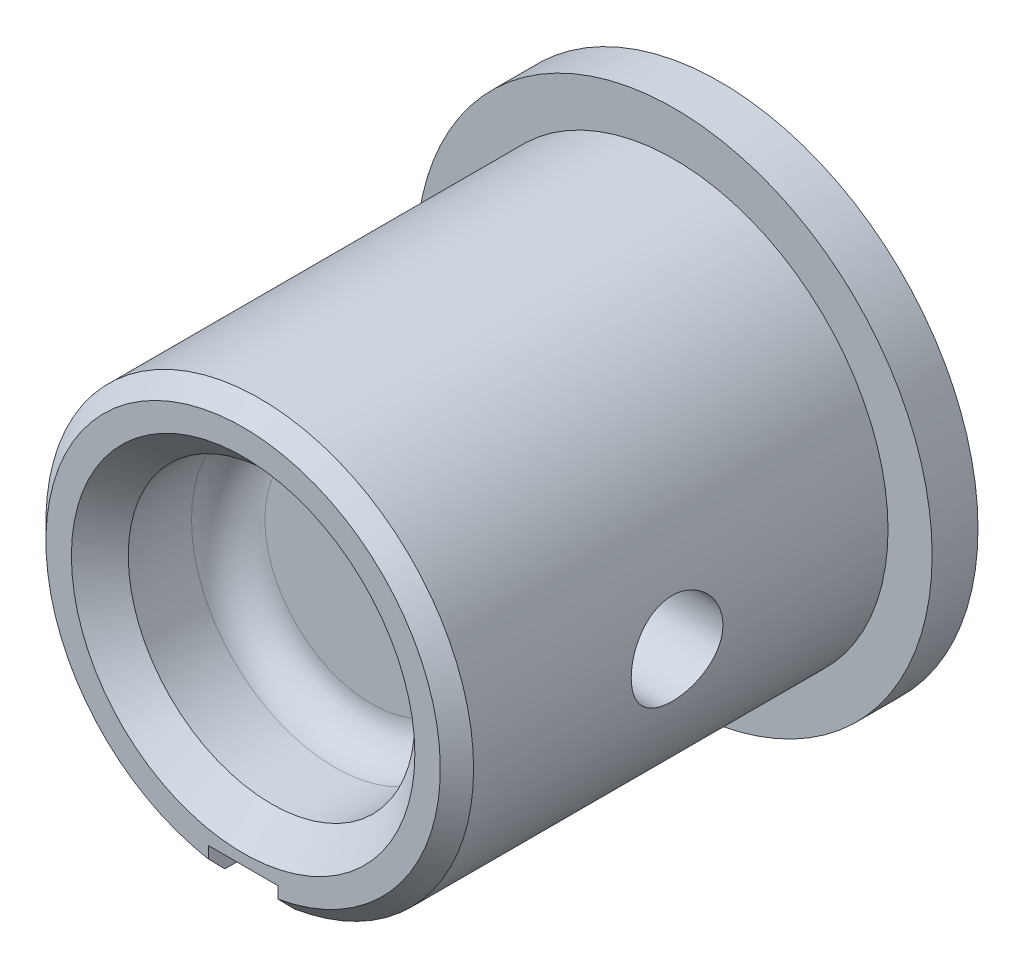
ISO-10303-21;
HEADER;
FILE_DESCRIPTION(('STEP AP214'),'2;1');
FILE_NAME('part.step','',(''),(''),'','','');
FILE_SCHEMA(('AUTOMOTIVE_DESIGN { 1 0 10303 214 1 1 1 1 }'));
ENDSEC;
DATA;
#1=APPLICATION_CONTEXT('core data for automotive mechanical design processes');
#2=APPLICATION_PROTOCOL_DEFINITION('international standard','automotive_design',2000,#1);
#3=PRODUCT_CONTEXT('',#1,'mechanical');
#4=PRODUCT('Part','Part','',(#3));
#5=PRODUCT_RELATED_PRODUCT_CATEGORY('part','',(#4));
#6=PRODUCT_DEFINITION_FORMATION('','',#4);
#7=PRODUCT_DEFINITION_CONTEXT('part definition',#1,'design');
#8=PRODUCT_DEFINITION('design','',#6,#7);
#9=PRODUCT_DEFINITION_SHAPE('','',#8);
#10=(LENGTH_UNIT() NAMED_UNIT(*) SI_UNIT(.MILLI.,.METRE.));
#11=(NAMED_UNIT(*) PLANE_ANGLE_UNIT() SI_UNIT($,.RADIAN.));
#12=(NAMED_UNIT(*) SI_UNIT($,.STERADIAN.) SOLID_ANGLE_UNIT());
#13=UNCERTAINTY_MEASURE_WITH_UNIT(LENGTH_MEASURE(1.E-05),#10,'distance_accuracy_value','');
#14=(GEOMETRIC_REPRESENTATION_CONTEXT(3) GLOBAL_UNCERTAINTY_ASSIGNED_CONTEXT((#13)) GLOBAL_UNIT_ASSIGNED_CONTEXT((#10,
#11,#12)) REPRESENTATION_CONTEXT('',''));
#15=CARTESIAN_POINT('',(0.,0.,0.));
#16=DIRECTION('',(0.,0.,1.));
#17=DIRECTION('',(1.,0.,0.));
#18=AXIS2_PLACEMENT_3D('',#15,#16,#17);
#19=CARTESIAN_POINT('',(2.96275000000001,2.96275000000001,8.382));
#20=DIRECTION('',(0.,0.,1.));
#21=DIRECTION('',(-1.,0.,0.));
#22=AXIS2_PLACEMENT_3D('',#19,#20,#21);
#23=PLANE('',#22);
#24=CARTESIAN_POINT('',(0.,0.,8.382));
#25=DIRECTION('',(0.,0.,-1.));
#26=DIRECTION('',(-1.,0.,0.));
#27=AXIS2_PLACEMENT_3D('',#24,#25,#26);
#28=CIRCLE('',#27,2.95275);
#29=CARTESIAN_POINT('',(-2.95275,0.,8.382));
#30=VERTEX_POINT('',#29);
#31=EDGE_CURVE('E21',#30,#30,#28,.T.);
#32=ORIENTED_EDGE('',*,*,#31,.F.);
#33=EDGE_LOOP('',(#32));
#34=FACE_BOUND('',#33,.T.);
#35=ADVANCED_FACE('F16',(#34),#23,.T.);
#36=CARTESIAN_POINT('',(0.,0.,9.398));
#37=DIRECTION('',(0.,0.,-1.));
#38=DIRECTION('',(-1.,0.,0.));
#39=AXIS2_PLACEMENT_3D('',#36,#37,#38);
#40=TOROIDAL_SURFACE('',#39,2.95275,1.016);
#41=CARTESIAN_POINT('',(0.,0.,9.398));
#42=DIRECTION('',(0.,0.,-1.));
#43=DIRECTION('',(-1.,0.,0.));
#44=AXIS2_PLACEMENT_3D('',#41,#42,#43);
#45=CIRCLE('',#44,3.96875);
#46=CARTESIAN_POINT('',(-3.96875,0.,9.398));
#47=VERTEX_POINT('',#46);
#48=EDGE_CURVE('E109',#47,#47,#45,.T.);
#49=ORIENTED_EDGE('',*,*,#48,.F.);
#50=EDGE_LOOP('',(#49));
#51=FACE_BOUND('',#50,.T.);
#52=ORIENTED_EDGE('',*,*,#31,.T.);
#53=EDGE_LOOP('',(#52));
#54=FACE_BOUND('',#53,.T.);
#55=ADVANCED_FACE('F172',(#51,#54),#40,.F.);
#56=CARTESIAN_POINT('',(7.15375000000001,-7.15375000000001,-1.26999999999999));
#57=DIRECTION('',(0.,0.,-1.));
#58=DIRECTION('',(-1.,0.,0.));
#59=AXIS2_PLACEMENT_3D('',#56,#57,#58);
#60=PLANE('',#59);
#61=CARTESIAN_POINT('',(0.,0.,-1.26999999999999));
#62=DIRECTION('',(0.,0.,1.));
#63=DIRECTION('',(1.,0.,0.));
#64=AXIS2_PLACEMENT_3D('',#61,#62,#63);
#65=CIRCLE('',#64,7.14375);
#66=CARTESIAN_POINT('',(7.14375,0.,-1.26999999999999));
#67=VERTEX_POINT('',#66);
#68=EDGE_CURVE('E108',#67,#67,#65,.T.);
#69=ORIENTED_EDGE('',*,*,#68,.F.);
#70=EDGE_LOOP('',(#69));
#71=FACE_BOUND('',#70,.T.);
#72=ADVANCED_FACE('F169',(#71),#60,.T.);
#73=CARTESIAN_POINT('',(0.,0.,11.1506));
#74=DIRECTION('',(0.,0.,-1.));
#75=DIRECTION('',(-1.,0.,0.));
#76=AXIS2_PLACEMENT_3D('',#73,#74,#75);
#77=CYLINDRICAL_SURFACE('',#76,3.96875);
#78=ORIENTED_EDGE('',*,*,#48,.T.);
#79=EDGE_LOOP('',(#78));
#80=FACE_BOUND('',#79,.T.);
#81=CARTESIAN_POINT('',(0.,0.,11.1506));
#82=DIRECTION('',(0.,0.,-1.));
#83=DIRECTION('',(-1.,0.,0.));
#84=AXIS2_PLACEMENT_3D('',#81,#82,#83);
#85=CIRCLE('',#84,3.96875);
#86=CARTESIAN_POINT('',(-3.96875,0.,11.1506));
#87=VERTEX_POINT('',#86);
#88=EDGE_CURVE('E104',#87,#87,#85,.T.);
#89=ORIENTED_EDGE('',*,*,#88,.F.);
#90=EDGE_LOOP('',(#89));
#91=FACE_BOUND('',#90,.T.);
#92=ADVANCED_FACE('F171',(#80,#91),#77,.F.);
#93=CARTESIAN_POINT('',(0.,0.,-1.27));
#94=DIRECTION('',(0.,0.,1.));
#95=DIRECTION('',(1.,0.,0.));
#96=AXIS2_PLACEMENT_3D('',#93,#94,#95);
#97=CYLINDRICAL_SURFACE('',#96,7.14375);
#98=CARTESIAN_POINT('',(0.,0.,0.));
#99=DIRECTION('',(0.,0.,1.));
#100=DIRECTION('',(1.,0.,0.));
#101=AXIS2_PLACEMENT_3D('',#98,#99,#100);
#102=CIRCLE('',#101,7.14375);
#103=CARTESIAN_POINT('',(7.14375,0.,0.));
#104=VERTEX_POINT('',#103);
#105=EDGE_CURVE('E107',#104,#104,#102,.T.);
#106=ORIENTED_EDGE('',*,*,#105,.F.);
#107=EDGE_LOOP('',(#106));
#108=FACE_BOUND('',#107,.T.);
#109=ORIENTED_EDGE('',*,*,#68,.T.);
#110=EDGE_LOOP('',(#109));
#111=FACE_BOUND('',#110,.T.);
#112=ADVANCED_FACE('F167',(#108,#111),#97,.T.);
#113=CARTESIAN_POINT('',(0.,0.,11.1506));
#114=DIRECTION('',(0.,0.,1.));
#115=DIRECTION('',(1.,0.,0.));
#116=AXIS2_PLACEMENT_3D('',#113,#114,#115);
#117=CONICAL_SURFACE('',#116,3.96875,0.785398163397448);
#118=ORIENTED_EDGE('',*,*,#88,.T.);
#119=EDGE_LOOP('',(#118));
#120=FACE_BOUND('',#119,.T.);
#121=CARTESIAN_POINT('',(0.,0.,11.938));
#122=DIRECTION('',(0.,0.,1.));
#123=DIRECTION('',(1.,0.,0.));
#124=AXIS2_PLACEMENT_3D('',#121,#122,#123);
#125=CIRCLE('',#124,4.75615);
#126=CARTESIAN_POINT('',(4.75615,0.,11.938));
#127=VERTEX_POINT('',#126);
#128=EDGE_CURVE('E153',#127,#127,#125,.F.);
#129=ORIENTED_EDGE('',*,*,#128,.F.);
#130=EDGE_LOOP('',(#129));
#131=FACE_BOUND('',#130,.T.);
#132=ADVANCED_FACE('F211',(#120,#131),#117,.F.);
#133=CARTESIAN_POINT('',(-7.15375000000001,-7.15374999999999,0.));
#134=DIRECTION('',(0.,0.,1.));
#135=DIRECTION('',(1.,0.,0.));
#136=AXIS2_PLACEMENT_3D('',#133,#134,#135);
#137=PLANE('',#136);
#138=CARTESIAN_POINT('',(0.,0.,0.));
#139=DIRECTION('',(0.,0.,1.));
#140=DIRECTION('',(1.,0.,0.));
#141=AXIS2_PLACEMENT_3D('',#138,#139,#140);
#142=CIRCLE('',#141,5.92201);
#143=CARTESIAN_POINT('',(5.92201,0.,0.));
#144=VERTEX_POINT('',#143);
#145=EDGE_CURVE('E152',#144,#144,#142,.T.);
#146=ORIENTED_EDGE('',*,*,#145,.F.);
#147=EDGE_LOOP('',(#146));
#148=FACE_BOUND('',#147,.T.);
#149=ORIENTED_EDGE('',*,*,#105,.T.);
#150=EDGE_LOOP('',(#149));
#151=FACE_BOUND('',#150,.T.);
#152=ADVANCED_FACE('F208',(#148,#151),#137,.T.);
#153=CARTESIAN_POINT('',(0.,0.,11.47699));
#154=DIRECTION('',(0.,0.,-1.));
#155=DIRECTION('',(-1.,0.,0.));
#156=AXIS2_PLACEMENT_3D('',#153,#154,#155);
#157=CONICAL_SURFACE('',#156,5.92201,0.785398163397456);
#158=CARTESIAN_POINT('',(0.9652,-5.84282392342093,11.47699));
#159=CARTESIAN_POINT('',(0.965200000000001,-5.76490383498512,11.5538718263506));
#160=CARTESIAN_POINT('',(0.965200000000001,-5.68696067294473,11.6307302393856));
#161=CARTESIAN_POINT('',(0.965200000000001,-5.53102820108529,11.784400239386));
#162=CARTESIAN_POINT('',(0.965200000000002,-5.4530388912659,11.8612118263509));
#163=CARTESIAN_POINT('',(0.965200000000002,-5.37502650784161,11.938));
#164=B_SPLINE_CURVE_WITH_KNOTS('',3,(#158,#159,#160,#161,#162,#163),.UNSPECIFIED.,.F.,.F.,(4,2,
4),(0.,0.32839179263205,0.656783587662925),.UNSPECIFIED.);
#165=CARTESIAN_POINT('',(0.965200000000001,-5.84282392342093,11.47699));
#166=VERTEX_POINT('',#165);
#167=CARTESIAN_POINT('',(0.965200000000002,-5.37502650784161,11.938));
#168=VERTEX_POINT('',#167);
#169=EDGE_CURVE('E86',#166,#168,#164,.T.);
#170=ORIENTED_EDGE('',*,*,#169,.F.);
#171=CARTESIAN_POINT('',(0.,0.,11.47699));
#172=DIRECTION('',(0.,0.,-1.));
#173=DIRECTION('',(-1.,0.,0.));
#174=AXIS2_PLACEMENT_3D('',#171,#172,#173);
#175=CIRCLE('',#174,5.92201);
#176=CARTESIAN_POINT('',(-0.9652,-5.84282392342093,11.47699));
#177=VERTEX_POINT('',#176);
#178=EDGE_CURVE('E196',#177,#166,#175,.T.);
#179=ORIENTED_EDGE('',*,*,#178,.F.);
#180=CARTESIAN_POINT('',(-0.9652,-5.84282392342093,11.47699));
#181=CARTESIAN_POINT('',(-0.9652,-5.76490383498512,11.5538718263506));
#182=CARTESIAN_POINT('',(-0.9652,-5.68696067294473,11.6307302393856));
#183=CARTESIAN_POINT('',(-0.9652,-5.53102820108529,11.784400239386));
#184=CARTESIAN_POINT('',(-0.9652,-5.4530388912659,11.8612118263509));
#185=CARTESIAN_POINT('',(-0.9652,-5.37502650784161,11.938));
#186=B_SPLINE_CURVE_WITH_KNOTS('',3,(#180,#181,#182,#183,#184,#185),.UNSPECIFIED.,.F.,.F.,(4,2,
4),(0.,0.328391792632049,0.656783587662922),.UNSPECIFIED.);
#187=CARTESIAN_POINT('',(-0.965199999999999,-5.37502650784161,11.938));
#188=VERTEX_POINT('',#187);
#189=EDGE_CURVE('E60',#177,#188,#186,.T.);
#190=ORIENTED_EDGE('',*,*,#189,.T.);
#191=CARTESIAN_POINT('',(0.,0.,11.938));
#192=DIRECTION('',(0.,0.,-1.));
#193=DIRECTION('',(-1.,0.,0.));
#194=AXIS2_PLACEMENT_3D('',#191,#192,#193);
#195=CIRCLE('',#194,5.46099999999999);
#196=EDGE_CURVE('E156',#168,#188,#195,.F.);
#197=ORIENTED_EDGE('',*,*,#196,.F.);
#198=EDGE_LOOP('',(#170,#179,#190,#197));
#199=FACE_BOUND('',#198,.T.);
#200=ADVANCED_FACE('F132',(#199),#157,.T.);
#201=CARTESIAN_POINT('',(-6.0404502,0.,5.842));
#202=DIRECTION('',(1.,0.,0.));
#203=DIRECTION('',(0.,1.,0.));
#204=AXIS2_PLACEMENT_3D('',#201,#202,#203);
#205=CYLINDRICAL_SURFACE('',#204,1.27);
#206=CARTESIAN_POINT('',(5.78422876796034,-1.27000000000001,5.842));
#207=CARTESIAN_POINT('',(5.78423019043854,-1.26999753154441,5.91245070838072));
#208=CARTESIAN_POINT('',(5.78552989364852,-1.26411790053726,5.98293141257982));
#209=CARTESIAN_POINT('',(5.79057917663973,-1.24077901258341,6.12189095327402));
#210=CARTESIAN_POINT('',(5.7943305720035,-1.22331117393029,6.19036826687874));
#211=CARTESIAN_POINT('',(5.80383927760964,-1.17736912725354,6.32329075856355));
#212=CARTESIAN_POINT('',(5.80959443490341,-1.14890672879198,6.38774017711405));
#213=CARTESIAN_POINT('',(5.82245961990261,-1.08181697159541,6.51094981315048));
#214=CARTESIAN_POINT('',(5.82956960854718,-1.04318990590359,6.56971019458222));
#215=CARTESIAN_POINT('',(5.84447236616351,-0.956198497594472,6.68082963727089));
#216=CARTESIAN_POINT('',(5.85227358107198,-0.907700352935912,6.73308283498115));
#217=CARTESIAN_POINT('',(5.86760575776913,-0.802632376259982,6.82877817039549));
#218=CARTESIAN_POINT('',(5.87513669901522,-0.746061932313849,6.87221963951253));
#219=CARTESIAN_POINT('',(5.88917156935918,-0.625747449440326,6.94947526697141));
#220=CARTESIAN_POINT('',(5.89566437214772,-0.561936803383418,6.98318788937305));
#221=CARTESIAN_POINT('',(5.90679612290519,-0.429393628697959,7.03937234606026));
#222=CARTESIAN_POINT('',(5.91143527071322,-0.360661631573719,7.06184539212943));
#223=CARTESIAN_POINT('',(5.91827732461187,-0.22132707345288,7.09458060902383));
#224=CARTESIAN_POINT('',(5.92051592380924,-0.1507683670633,7.10502185731504));
#225=CARTESIAN_POINT('',(5.92242822466802,-0.00886764709374305,7.1139567112793));
#226=CARTESIAN_POINT('',(5.92210220886384,0.0624742793369867,7.11245163303599));
#227=CARTESIAN_POINT('',(5.91894938070722,0.202682733343538,7.09767050837815));
#228=CARTESIAN_POINT('',(5.91616357209747,0.271570664000413,7.0845874540888));
#229=CARTESIAN_POINT('',(5.9084507780475,0.406149950693562,7.04732895961608));
#230=CARTESIAN_POINT('',(5.90352369829368,0.471841165786798,7.02315303083761));
#231=CARTESIAN_POINT('',(5.89201564430516,0.598701518736068,6.9642224514072));
#232=CARTESIAN_POINT('',(5.88542320047035,0.659835323313237,6.92939406999802));
#233=CARTESIAN_POINT('',(5.87130819580074,0.775461384272286,6.85020211284713));
#234=CARTESIAN_POINT('',(5.86378551290536,0.829952767207406,6.80583728522324));
#235=CARTESIAN_POINT('',(5.84846044762657,0.931894431065656,6.70777917393295));
#236=CARTESIAN_POINT('',(5.8406554805794,0.979181983916719,6.65391697740179));
#237=CARTESIAN_POINT('',(5.82578696313064,1.06408267605516,6.53894667757514));
#238=CARTESIAN_POINT('',(5.81872343128937,1.10169557319132,6.47783839297005));
#239=CARTESIAN_POINT('',(5.80613110571408,1.16624772230353,6.34985441621531));
#240=CARTESIAN_POINT('',(5.80060659644426,1.19315726459274,6.28296328953211));
#241=CARTESIAN_POINT('',(5.79177793610174,1.23530533994071,6.14546224665799));
#242=CARTESIAN_POINT('',(5.78847344783675,1.25054564545379,6.07485289697441));
#243=CARTESIAN_POINT('',(5.78452746826554,1.26867239867339,5.93340382879525));
#244=CARTESIAN_POINT('',(5.7838350078289,1.27179533072558,5.8625958027241));
#245=CARTESIAN_POINT('',(5.7850541547333,1.26623802655927,5.72147083253193));
#246=CARTESIAN_POINT('',(5.78696559062974,1.25755856742876,5.65115385638578));
#247=CARTESIAN_POINT('',(5.7931291223186,1.22884773762429,5.51382370340441));
#248=CARTESIAN_POINT('',(5.79735453568513,1.20894569804889,5.44678218039866));
#249=CARTESIAN_POINT('',(5.8076460134063,1.15849427403012,5.31698525181254));
#250=CARTESIAN_POINT('',(5.81371224828175,1.12794390316094,5.25423024396495));
#251=CARTESIAN_POINT('',(5.8271144338426,1.05653865754823,5.1337616501605));
#252=CARTESIAN_POINT('',(5.83446789449694,1.01553756325132,5.07613672024113));
#253=CARTESIAN_POINT('',(5.8495693702786,0.924586906015828,4.9684984503159));
#254=CARTESIAN_POINT('',(5.857317432337,0.874636276896231,4.91848601852085));
#255=CARTESIAN_POINT('',(5.87250250521467,0.766136322872264,4.82657952574813));
#256=CARTESIAN_POINT('',(5.87993149092007,0.707449378607737,4.78484638258286));
#257=CARTESIAN_POINT('',(5.89349567131357,0.583760371144479,4.71183165158194));
#258=CARTESIAN_POINT('',(5.89963092512168,0.518758596714544,4.68054958612249));
#259=CARTESIAN_POINT('',(5.90988242197144,0.384681770381866,4.62955157092732));
#260=CARTESIAN_POINT('',(5.91401113744788,0.315634950410984,4.60976401825449));
#261=CARTESIAN_POINT('',(5.91983819193875,0.175099001424665,4.5820922882636));
#262=CARTESIAN_POINT('',(5.92153686987843,0.103610214422679,4.57420645096602));
#263=CARTESIAN_POINT('',(5.9223028730066,-0.0382505685620396,4.57063421322772));
#264=CARTESIAN_POINT('',(5.92142210418266,-0.108616333110921,4.57470717122595));
#265=CARTESIAN_POINT('',(5.91723889748306,-0.247635611723449,4.59440027603785));
#266=CARTESIAN_POINT('',(5.91393649990504,-0.31628915426004,4.61002023070127));
#267=CARTESIAN_POINT('',(5.90528438236595,-0.449757522659775,4.6522505262292));
#268=CARTESIAN_POINT('',(5.89994079680882,-0.514583184958104,4.67882795527934));
#269=CARTESIAN_POINT('',(5.88777801268395,-0.638887677684329,4.74218619207701));
#270=CARTESIAN_POINT('',(5.88095867694329,-0.698366010343033,4.77896794841973));
#271=CARTESIAN_POINT('',(5.86643341213001,-0.811465136845,4.86248179900502));
#272=CARTESIAN_POINT('',(5.85871353043912,-0.864958671566026,4.90938382447386));
#273=CARTESIAN_POINT('',(5.84333417709668,-0.963398299582799,5.01146252756262));
#274=CARTESIAN_POINT('',(5.83567472038098,-1.00834233937706,5.06664118746798));
#275=CARTESIAN_POINT('',(5.8211749682022,-1.08895723139194,5.18455200743988));
#276=CARTESIAN_POINT('',(5.81434635420928,-1.12450262617829,5.24737145632032));
#277=CARTESIAN_POINT('',(5.80242727331532,-1.18447556110446,5.37822420544932));
#278=CARTESIAN_POINT('',(5.7973353111475,-1.20891267160342,5.44625295833588));
#279=CARTESIAN_POINT('',(5.79042532915277,-1.24152327444964,5.56897652136881));
#280=CARTESIAN_POINT('',(5.78811679633005,-1.25218189692962,5.62299711227899));
#281=CARTESIAN_POINT('',(5.7850179946247,-1.26642106387642,5.73200573599247));
#282=CARTESIAN_POINT('',(5.78422765732243,-1.27000192731274,5.78699372508589));
#283=CARTESIAN_POINT('',(5.78422876796034,-1.27000000000001,5.842));
#284=B_SPLINE_CURVE_WITH_KNOTS('',3,(#206,#207,#208,#209,#210,#211,#212,#213,#214,#215,#216,
#217,#218,#219,#220,#221,#222,#223,#224,#225,#226,#227,#228,#229,#230,#231,#232,#233,#234,#235,
#236,#237,#238,#239,#240,#241,#242,#243,#244,#245,#246,#247,#248,#249,#250,#251,#252,#253,#254,
#255,#256,#257,#258,#259,#260,#261,#262,#263,#264,#265,#266,#267,#268,#269,#270,#271,#272,#273,
#274,#275,#276,#277,#278,#279,#280,#281,#282,#283),.UNSPECIFIED.,.T.,.F.,(4,2,2,2,2,2,2,2,2,2,2,
2,2,2,2,2,2,2,2,2,2,2,2,2,2,2,2,2,2,2,2,2,2,2,2,2,2,2,4),(0.,0.211150577326392,
0.422457698107548,0.633538476356161,0.844613169899308,1.0587664048275,1.27293588248979,
1.48926579354851,1.70557237618521,1.91861615563496,2.131636465147,2.34117146950144,
2.55071570388959,2.76174443793511,2.97280089138693,3.18808097961901,3.40336645566692,
3.61924540550569,3.83509155872463,4.04670339197906,4.25830129305226,4.46750912330725,
4.67673633902922,4.88906912537049,5.10142722430077,5.31757741205463,5.53371772019593,
5.74849677015111,5.96324586124965,6.17370345521213,6.38415754708884,6.5939840727429,
6.80383011042949,7.0175201815673,7.231261514252,7.44772636830315,7.66400437160758,
7.82887326272725,7.99373472362161),.UNSPECIFIED.);
#285=CARTESIAN_POINT('',(5.78422876796034,-1.27000000000001,5.842));
#286=VERTEX_POINT('',#285);
#287=EDGE_CURVE('E119',#286,#286,#284,.T.);
#288=ORIENTED_EDGE('',*,*,#287,.F.);
#289=EDGE_LOOP('',(#288));
#290=FACE_BOUND('',#289,.T.);
#291=CARTESIAN_POINT('',(-5.78422876796034,-1.27,5.842));
#292=CARTESIAN_POINT('',(-5.78423019043854,-1.26999753154441,5.77154929161928));
#293=CARTESIAN_POINT('',(-5.78552989364852,-1.26411790053725,5.70106858742018));
#294=CARTESIAN_POINT('',(-5.79057917663973,-1.24077901258341,5.56210904672598));
#295=CARTESIAN_POINT('',(-5.7943305720035,-1.22331117393029,5.49363173312126));
#296=CARTESIAN_POINT('',(-5.80383927760964,-1.17736912725354,5.36070924143645));
#297=CARTESIAN_POINT('',(-5.80959443490341,-1.14890672879197,5.29625982288595));
#298=CARTESIAN_POINT('',(-5.82245961990261,-1.08181697159541,5.17305018684952));
#299=CARTESIAN_POINT('',(-5.82956960854718,-1.04318990590358,5.11428980541777));
#300=CARTESIAN_POINT('',(-5.84447236616351,-0.956198497594468,5.00317036272911));
#301=CARTESIAN_POINT('',(-5.85227358107198,-0.907700352935908,4.95091716501884));
#302=CARTESIAN_POINT('',(-5.86760575776913,-0.802632376259978,4.8552218296045));
#303=CARTESIAN_POINT('',(-5.87513669901522,-0.746061932313846,4.81178036048746));
#304=CARTESIAN_POINT('',(-5.88917156935918,-0.625747449440323,4.73452473302858));
#305=CARTESIAN_POINT('',(-5.89566437214772,-0.561936803383415,4.70081211062695));
#306=CARTESIAN_POINT('',(-5.90679612290519,-0.429393628697956,4.64462765393974));
#307=CARTESIAN_POINT('',(-5.91143527071322,-0.360661631573717,4.62215460787056));
#308=CARTESIAN_POINT('',(-5.91827732461187,-0.221327073452877,4.58941939097616));
#309=CARTESIAN_POINT('',(-5.92051592380924,-0.150768367063297,4.57897814268495));
#310=CARTESIAN_POINT('',(-5.92242822466802,-0.00886764709374088,4.57004328872069));
#311=CARTESIAN_POINT('',(-5.92210220886384,0.0624742793369889,4.57154836696401));
#312=CARTESIAN_POINT('',(-5.91894938070722,0.202682733343541,4.58632949162184));
#313=CARTESIAN_POINT('',(-5.91616357209747,0.271570664000416,4.59941254591119));
#314=CARTESIAN_POINT('',(-5.9084507780475,0.406149950693565,4.63667104038391));
#315=CARTESIAN_POINT('',(-5.90352369829368,0.4718411657868,4.66084696916238));
#316=CARTESIAN_POINT('',(-5.89201564430516,0.598701518736071,4.71977754859279));
#317=CARTESIAN_POINT('',(-5.88542320047035,0.65983532331324,4.75460593000197));
#318=CARTESIAN_POINT('',(-5.87130819580074,0.775461384272289,4.83379788715286));
#319=CARTESIAN_POINT('',(-5.86378551290536,0.829952767207409,4.87816271477675));
#320=CARTESIAN_POINT('',(-5.84846044762657,0.93189443106566,4.97622082606703));
#321=CARTESIAN_POINT('',(-5.8406554805794,0.979181983916723,5.0300830225982));
#322=CARTESIAN_POINT('',(-5.82578696313064,1.06408267605516,5.14505332242485));
#323=CARTESIAN_POINT('',(-5.81872343128937,1.10169557319133,5.20616160702994));
#324=CARTESIAN_POINT('',(-5.80613110571408,1.16624772230353,5.33414558378468));
#325=CARTESIAN_POINT('',(-5.80060659644426,1.19315726459275,5.40103671046788));
#326=CARTESIAN_POINT('',(-5.79177793610174,1.23530533994072,5.538537753342));
#327=CARTESIAN_POINT('',(-5.78847344783675,1.25054564545379,5.60914710302558));
#328=CARTESIAN_POINT('',(-5.78452746826554,1.2686723986734,5.75059617120474));
#329=CARTESIAN_POINT('',(-5.78383500782889,1.27179533072559,5.82140419727588));
#330=CARTESIAN_POINT('',(-5.7850541547333,1.26623802655928,5.96252916746806));
#331=CARTESIAN_POINT('',(-5.78696559062974,1.25755856742877,6.03284614361421));
#332=CARTESIAN_POINT('',(-5.7931291223186,1.2288477376243,6.17017629659558));
#333=CARTESIAN_POINT('',(-5.79735453568513,1.2089456980489,6.23721781960133));
#334=CARTESIAN_POINT('',(-5.8076460134063,1.15849427403013,6.36701474818745));
#335=CARTESIAN_POINT('',(-5.81371224828175,1.12794390316095,6.42976975603504));
#336=CARTESIAN_POINT('',(-5.8271144338426,1.05653865754824,6.55023834983949));
#337=CARTESIAN_POINT('',(-5.83446789449693,1.01553756325133,6.60786327975885));
#338=CARTESIAN_POINT('',(-5.8495693702786,0.92458690601584,6.71550154968409));
#339=CARTESIAN_POINT('',(-5.857317432337,0.874636276896244,6.76551398147914));
#340=CARTESIAN_POINT('',(-5.87250250521467,0.766136322872277,6.85742047425186));
#341=CARTESIAN_POINT('',(-5.87993149092007,0.70744937860775,6.89915361741713));
#342=CARTESIAN_POINT('',(-5.89349567131357,0.583760371144493,6.97216834841805));
#343=CARTESIAN_POINT('',(-5.89963092512168,0.518758596714558,7.0034504138775));
#344=CARTESIAN_POINT('',(-5.90988242197144,0.38468177038188,7.05444842907267));
#345=CARTESIAN_POINT('',(-5.91401113744788,0.315634950410998,7.07423598174551));
#346=CARTESIAN_POINT('',(-5.91983819193875,0.17509900142468,7.10190771173639));
#347=CARTESIAN_POINT('',(-5.92153686987843,0.103610214422694,7.10979354903397));
#348=CARTESIAN_POINT('',(-5.9223028730066,-0.0382505685620243,7.11336578677227));
#349=CARTESIAN_POINT('',(-5.92142210418266,-0.108616333110905,7.10929282877405));
#350=CARTESIAN_POINT('',(-5.91723889748306,-0.247635611723433,7.08959972396214));
#351=CARTESIAN_POINT('',(-5.91393649990504,-0.316289154260025,7.07397976929873));
#352=CARTESIAN_POINT('',(-5.90528438236595,-0.449757522659761,7.03174947377079));
#353=CARTESIAN_POINT('',(-5.89994079680883,-0.51458318495809,7.00517204472065));
#354=CARTESIAN_POINT('',(-5.88777801268395,-0.638887677684316,6.94181380792299));
#355=CARTESIAN_POINT('',(-5.8809586769433,-0.69836601034302,6.90503205158027));
#356=CARTESIAN_POINT('',(-5.86643341213001,-0.811465136844987,6.82151820099498));
#357=CARTESIAN_POINT('',(-5.85871353043912,-0.864958671566012,6.77461617552614));
#358=CARTESIAN_POINT('',(-5.84333417709668,-0.963398299582786,6.67253747243738));
#359=CARTESIAN_POINT('',(-5.83567472038098,-1.00834233937704,6.61735881253202));
#360=CARTESIAN_POINT('',(-5.82117496820221,-1.08895723139193,6.49944799256012));
#361=CARTESIAN_POINT('',(-5.81434635420928,-1.12450262617828,6.43662854367968));
#362=CARTESIAN_POINT('',(-5.80242727331533,-1.18447556110445,6.30577579455068));
#363=CARTESIAN_POINT('',(-5.79733531114751,-1.20891267160341,6.23774704166412));
#364=CARTESIAN_POINT('',(-5.79042532915277,-1.24152327444963,6.11502347863119));
#365=CARTESIAN_POINT('',(-5.78811679633005,-1.25218189692961,6.06100288772102));
#366=CARTESIAN_POINT('',(-5.7850179946247,-1.26642106387641,5.95199426400753));
#367=CARTESIAN_POINT('',(-5.78422765732244,-1.27000192731273,5.89700627491411));
#368=CARTESIAN_POINT('',(-5.78422876796034,-1.27,5.842));
#369=B_SPLINE_CURVE_WITH_KNOTS('',3,(#291,#292,#293,#294,#295,#296,#297,#298,#299,#300,#301,
#302,#303,#304,#305,#306,#307,#308,#309,#310,#311,#312,#313,#314,#315,#316,#317,#318,#319,#320,
#321,#322,#323,#324,#325,#326,#327,#328,#329,#330,#331,#332,#333,#334,#335,#336,#337,#338,#339,
#340,#341,#342,#343,#344,#345,#346,#347,#348,#349,#350,#351,#352,#353,#354,#355,#356,#357,#358,
#359,#360,#361,#362,#363,#364,#365,#366,#367,#368),.UNSPECIFIED.,.T.,.F.,(4,2,2,2,2,2,2,2,2,2,2,
2,2,2,2,2,2,2,2,2,2,2,2,2,2,2,2,2,2,2,2,2,2,2,2,2,2,2,4),(0.,0.211150577326391,
0.422457698107549,0.633538476356163,0.844613169899309,1.0587664048275,1.27293588248979,
1.48926579354851,1.70557237618521,1.91861615563496,2.131636465147,2.34117146950145,
2.55071570388959,2.76174443793512,2.97280089138693,3.18808097961901,3.40336645566692,
3.61924540550569,3.83509155872463,4.04670339197906,4.25830129305226,4.46750912330726,
4.67673633902923,4.8890691253705,5.10142722430077,5.31757741205463,5.53371772019594,
5.74849677015111,5.96324586124965,6.17370345521213,6.38415754708884,6.5939840727429,
6.80383011042949,7.0175201815673,7.231261514252,7.44772636830316,7.66400437160758,
7.82887326272725,7.99373472362161),.UNSPECIFIED.);
#370=CARTESIAN_POINT('',(-5.78422876796034,-1.27,5.842));
#371=VERTEX_POINT('',#370);
#372=EDGE_CURVE('E79',#371,#371,#369,.T.);
#373=ORIENTED_EDGE('',*,*,#372,.F.);
#374=EDGE_LOOP('',(#373));
#375=FACE_BOUND('',#374,.T.);
#376=ADVANCED_FACE('F127',(#290,#375),#205,.F.);
#377=CARTESIAN_POINT('',(-5.89273619321065,-5.3850265078416,11.938));
#378=DIRECTION('',(0.,0.,1.));
#379=DIRECTION('',(1.,0.,0.));
#380=AXIS2_PLACEMENT_3D('',#377,#378,#379);
#381=PLANE('',#380);
#382=ORIENTED_EDGE('',*,*,#128,.T.);
#383=EDGE_LOOP('',(#382));
#384=FACE_BOUND('',#383,.T.);
#385=DIRECTION('',(0.,1.,0.));
#386=VECTOR('',#385,1.);
#387=CARTESIAN_POINT('',(0.965200000000002,-5.44680696171047,11.938));
#388=LINE('',#387,#386);
#389=CARTESIAN_POINT('',(0.965200000000003,-5.05079,11.938));
#390=VERTEX_POINT('',#389);
#391=EDGE_CURVE('E73',#168,#390,#388,.T.);
#392=ORIENTED_EDGE('',*,*,#391,.F.);
#393=ORIENTED_EDGE('',*,*,#196,.T.);
#394=DIRECTION('',(0.,1.,0.));
#395=VECTOR('',#394,1.);
#396=CARTESIAN_POINT('',(-0.965199999999999,0.0429867460792067,11.938));
#397=LINE('',#396,#395);
#398=CARTESIAN_POINT('',(-0.9652,-5.05079,11.938));
#399=VERTEX_POINT('',#398);
#400=EDGE_CURVE('E36',#188,#399,#397,.T.);
#401=ORIENTED_EDGE('',*,*,#400,.T.);
#402=DIRECTION('',(-1.,0.,0.));
#403=VECTOR('',#402,1.);
#404=CARTESIAN_POINT('',(0.,-5.05079,11.938));
#405=LINE('',#404,#403);
#406=EDGE_CURVE('E70',#390,#399,#405,.T.);
#407=ORIENTED_EDGE('',*,*,#406,.F.);
#408=EDGE_LOOP('',(#392,#393,#401,#407));
#409=FACE_BOUND('',#408,.T.);
#410=ADVANCED_FACE('F72',(#384,#409),#381,.T.);
#411=CARTESIAN_POINT('',(0.975200000000004,-5.04078999999999,0.762));
#412=DIRECTION('',(0.,0.,1.));
#413=DIRECTION('',(-1.,0.,0.));
#414=AXIS2_PLACEMENT_3D('',#411,#412,#413);
#415=PLANE('',#414);
#416=CARTESIAN_POINT('',(0.,0.,0.762));
#417=DIRECTION('',(0.,0.,1.));
#418=DIRECTION('',(1.,0.,0.));
#419=AXIS2_PLACEMENT_3D('',#416,#417,#418);
#420=CIRCLE('',#419,5.92201);
#421=CARTESIAN_POINT('',(0.9652,-5.84282392342093,0.762000000000001));
#422=VERTEX_POINT('',#421);
#423=CARTESIAN_POINT('',(-0.9652,-5.84282392342093,0.762000000000001));
#424=VERTEX_POINT('',#423);
#425=EDGE_CURVE('E190',#422,#424,#420,.F.);
#426=ORIENTED_EDGE('',*,*,#425,.F.);
#427=DIRECTION('',(0.,-1.,0.));
#428=VECTOR('',#427,1.);
#429=CARTESIAN_POINT('',(0.965200000000002,-5.44680696171047,0.762000000000001));
#430=LINE('',#429,#428);
#431=CARTESIAN_POINT('',(0.965200000000003,-5.05079,0.762000000000001));
#432=VERTEX_POINT('',#431);
#433=EDGE_CURVE('E67',#432,#422,#430,.T.);
#434=ORIENTED_EDGE('',*,*,#433,.F.);
#435=DIRECTION('',(1.,0.,0.));
#436=VECTOR('',#435,1.);
#437=CARTESIAN_POINT('',(0.,-5.05079,0.762000000000001));
#438=LINE('',#437,#436);
#439=CARTESIAN_POINT('',(-0.9652,-5.05079,0.762000000000001));
#440=VERTEX_POINT('',#439);
#441=EDGE_CURVE('E78',#440,#432,#438,.T.);
#442=ORIENTED_EDGE('',*,*,#441,.F.);
#443=DIRECTION('',(0.,-1.,0.));
#444=VECTOR('',#443,1.);
#445=CARTESIAN_POINT('',(-0.9652,-5.52652963110887,0.762));
#446=LINE('',#445,#444);
#447=EDGE_CURVE('E151',#440,#424,#446,.T.);
#448=ORIENTED_EDGE('',*,*,#447,.T.);
#449=EDGE_LOOP('',(#426,#434,#442,#448));
#450=FACE_BOUND('',#449,.T.);
#451=ADVANCED_FACE('F139',(#450),#415,.T.);
#452=CARTESIAN_POINT('',(0.9652,-5.85282392342095,11.948));
#453=DIRECTION('',(-1.,0.,0.));
#454=DIRECTION('',(0.,1.,0.));
#455=AXIS2_PLACEMENT_3D('',#452,#453,#454);
#456=PLANE('',#455);
#457=ORIENTED_EDGE('',*,*,#433,.T.);
#458=DIRECTION('',(0.,0.,-1.));
#459=VECTOR('',#458,1.);
#460=CARTESIAN_POINT('',(0.965200000000001,-5.84282392342093,5.738495));
#461=LINE('',#460,#459);
#462=EDGE_CURVE('E193',#166,#422,#461,.T.);
#463=ORIENTED_EDGE('',*,*,#462,.F.);
#464=ORIENTED_EDGE('',*,*,#169,.T.);
#465=ORIENTED_EDGE('',*,*,#391,.T.);
#466=DIRECTION('',(0.,0.,1.));
#467=VECTOR('',#466,1.);
#468=CARTESIAN_POINT('',(0.965200000000003,-5.05079,6.35000000000001));
#469=LINE('',#468,#467);
#470=EDGE_CURVE('E83',#432,#390,#469,.T.);
#471=ORIENTED_EDGE('',*,*,#470,.F.);
#472=EDGE_LOOP('',(#457,#463,#464,#465,#471));
#473=FACE_BOUND('',#472,.T.);
#474=ADVANCED_FACE('F82',(#473),#456,.T.);
#475=CARTESIAN_POINT('',(0.,0.,0.));
#476=DIRECTION('',(0.,0.,1.));
#477=DIRECTION('',(1.,0.,0.));
#478=AXIS2_PLACEMENT_3D('',#475,#476,#477);
#479=CYLINDRICAL_SURFACE('',#478,5.92201);
#480=ORIENTED_EDGE('',*,*,#425,.T.);
#481=DIRECTION('',(0.,0.,-1.));
#482=VECTOR('',#481,1.);
#483=CARTESIAN_POINT('',(-0.9652,-5.84282392342093,6.35000000000001));
#484=LINE('',#483,#482);
#485=EDGE_CURVE('E27',#177,#424,#484,.T.);
#486=ORIENTED_EDGE('',*,*,#485,.F.);
#487=ORIENTED_EDGE('',*,*,#178,.T.);
#488=ORIENTED_EDGE('',*,*,#462,.T.);
#489=EDGE_LOOP('',(#480,#486,#487,#488));
#490=FACE_BOUND('',#489,.T.);
#491=ORIENTED_EDGE('',*,*,#372,.T.);
#492=EDGE_LOOP('',(#491));
#493=FACE_BOUND('',#492,.T.);
#494=ORIENTED_EDGE('',*,*,#287,.T.);
#495=EDGE_LOOP('',(#494));
#496=FACE_BOUND('',#495,.T.);
#497=ORIENTED_EDGE('',*,*,#145,.T.);
#498=EDGE_LOOP('',(#497));
#499=FACE_BOUND('',#498,.T.);
#500=ADVANCED_FACE('F124',(#490,#493,#496,#499),#479,.T.);
#501=CARTESIAN_POINT('',(0.975200000000004,-5.05079,11.948));
#502=DIRECTION('',(0.,-1.,0.));
#503=DIRECTION('',(-1.,0.,0.));
#504=AXIS2_PLACEMENT_3D('',#501,#502,#503);
#505=PLANE('',#504);
#506=ORIENTED_EDGE('',*,*,#441,.T.);
#507=ORIENTED_EDGE('',*,*,#470,.T.);
#508=ORIENTED_EDGE('',*,*,#406,.T.);
#509=DIRECTION('',(0.,0.,1.));
#510=VECTOR('',#509,1.);
#511=CARTESIAN_POINT('',(-0.9652,-5.05079,6.35000000000001));
#512=LINE('',#511,#510);
#513=EDGE_CURVE('E11',#440,#399,#512,.T.);
#514=ORIENTED_EDGE('',*,*,#513,.F.);
#515=EDGE_LOOP('',(#506,#507,#508,#514));
#516=FACE_BOUND('',#515,.T.);
#517=ADVANCED_FACE('F88',(#516),#505,.T.);
#518=CARTESIAN_POINT('',(-0.9652,-5.04078999999999,11.948));
#519=DIRECTION('',(1.,0.,0.));
#520=DIRECTION('',(0.,-1.,0.));
#521=AXIS2_PLACEMENT_3D('',#518,#519,#520);
#522=PLANE('',#521);
#523=ORIENTED_EDGE('',*,*,#513,.T.);
#524=ORIENTED_EDGE('',*,*,#400,.F.);
#525=ORIENTED_EDGE('',*,*,#189,.F.);
#526=ORIENTED_EDGE('',*,*,#485,.T.);
#527=ORIENTED_EDGE('',*,*,#447,.F.);
#528=EDGE_LOOP('',(#523,#524,#525,#526,#527));
#529=FACE_BOUND('',#528,.T.);
#530=ADVANCED_FACE('F18',(#529),#522,.T.);
#531=CLOSED_SHELL('',(#35,#55,#72,#92,#112,#132,#152,#200,#376,#410,#451,#474,#500,#517,#530));
#532=MANIFOLD_SOLID_BREP('B1',#531);
#533=ADVANCED_BREP_SHAPE_REPRESENTATION('',(#18,#532),#14);
#534=SHAPE_DEFINITION_REPRESENTATION(#9,#533);
ENDSEC;
END-ISO-10303-21;
